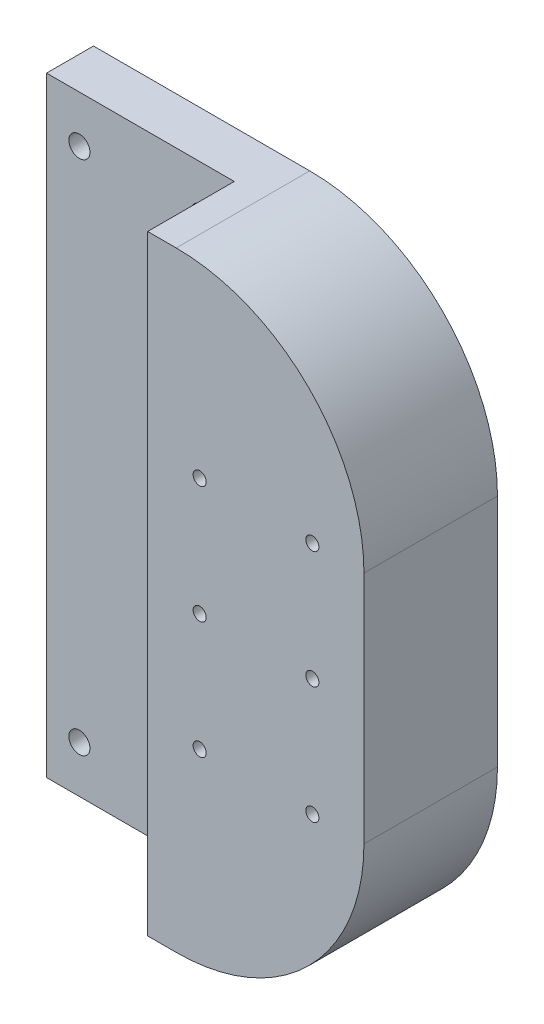
ISO-10303-21;
HEADER;
FILE_DESCRIPTION(('STEP AP214'),'2;1');
FILE_NAME('part.step','',(''),(''),'','','');
FILE_SCHEMA(('AUTOMOTIVE_DESIGN { 1 0 10303 214 1 1 1 1 }'));
ENDSEC;
DATA;
#1=APPLICATION_CONTEXT('core data for automotive mechanical design processes');
#2=APPLICATION_PROTOCOL_DEFINITION('international standard','automotive_design',2000,#1);
#3=PRODUCT_CONTEXT('',#1,'mechanical');
#4=PRODUCT('Part','Part','',(#3));
#5=PRODUCT_RELATED_PRODUCT_CATEGORY('part','',(#4));
#6=PRODUCT_DEFINITION_FORMATION('','',#4);
#7=PRODUCT_DEFINITION_CONTEXT('part definition',#1,'design');
#8=PRODUCT_DEFINITION('design','',#6,#7);
#9=PRODUCT_DEFINITION_SHAPE('','',#8);
#10=(LENGTH_UNIT() NAMED_UNIT(*) SI_UNIT(.MILLI.,.METRE.));
#11=(NAMED_UNIT(*) PLANE_ANGLE_UNIT() SI_UNIT($,.RADIAN.));
#12=(NAMED_UNIT(*) SI_UNIT($,.STERADIAN.) SOLID_ANGLE_UNIT());
#13=UNCERTAINTY_MEASURE_WITH_UNIT(LENGTH_MEASURE(1.E-05),#10,'distance_accuracy_value','');
#14=(GEOMETRIC_REPRESENTATION_CONTEXT(3) GLOBAL_UNCERTAINTY_ASSIGNED_CONTEXT((#13)) GLOBAL_UNIT_ASSIGNED_CONTEXT((#10,
#11,#12)) REPRESENTATION_CONTEXT('',''));
#15=CARTESIAN_POINT('',(0.,0.,0.));
#16=DIRECTION('',(0.,0.,1.));
#17=DIRECTION('',(1.,0.,0.));
#18=AXIS2_PLACEMENT_3D('',#15,#16,#17);
#19=CARTESIAN_POINT('',(0.,0.,10.));
#20=DIRECTION('',(0.,0.,1.));
#21=DIRECTION('',(1.,0.,0.));
#22=AXIS2_PLACEMENT_3D('',#19,#20,#21);
#23=PLANE('',#22);
#24=CARTESIAN_POINT('',(-36.042,55.0000004842877,10.));
#25=DIRECTION('',(0.,0.,1.));
#26=DIRECTION('',(1.,0.,0.));
#27=AXIS2_PLACEMENT_3D('',#24,#25,#26);
#28=CIRCLE('',#27,2.25000000000001);
#29=CARTESIAN_POINT('',(-33.792,55.0000004842877,10.));
#30=VERTEX_POINT('',#29);
#31=EDGE_CURVE('E156',#30,#30,#28,.T.);
#32=ORIENTED_EDGE('',*,*,#31,.F.);
#33=EDGE_LOOP('',(#32));
#34=FACE_BOUND('',#33,.T.);
#35=CARTESIAN_POINT('',(-10.042,-54.9999995157123,10.));
#36=DIRECTION('',(0.,0.,1.));
#37=DIRECTION('',(1.,0.,0.));
#38=AXIS2_PLACEMENT_3D('',#35,#36,#37);
#39=CIRCLE('',#38,2.25000000000001);
#40=CARTESIAN_POINT('',(-7.79200000000001,-54.9999995157123,10.));
#41=VERTEX_POINT('',#40);
#42=EDGE_CURVE('E153',#41,#41,#39,.T.);
#43=ORIENTED_EDGE('',*,*,#42,.F.);
#44=EDGE_LOOP('',(#43));
#45=FACE_BOUND('',#44,.T.);
#46=CARTESIAN_POINT('',(-36.042,-54.9999995157123,10.));
#47=DIRECTION('',(0.,0.,1.));
#48=DIRECTION('',(1.,0.,0.));
#49=AXIS2_PLACEMENT_3D('',#46,#47,#48);
#50=CIRCLE('',#49,2.25000000000001);
#51=CARTESIAN_POINT('',(-33.792,-54.9999995157123,10.));
#52=VERTEX_POINT('',#51);
#53=EDGE_CURVE('E149',#52,#52,#50,.T.);
#54=ORIENTED_EDGE('',*,*,#53,.F.);
#55=EDGE_LOOP('',(#54));
#56=FACE_BOUND('',#55,.T.);
#57=CARTESIAN_POINT('',(-10.042,55.0000004842877,10.));
#58=DIRECTION('',(0.,0.,1.));
#59=DIRECTION('',(1.,0.,0.));
#60=AXIS2_PLACEMENT_3D('',#57,#58,#59);
#61=CIRCLE('',#60,2.25000000000001);
#62=CARTESIAN_POINT('',(-7.79200000000001,55.0000004842877,10.));
#63=VERTEX_POINT('',#62);
#64=EDGE_CURVE('E146',#63,#63,#61,.T.);
#65=ORIENTED_EDGE('',*,*,#64,.F.);
#66=EDGE_LOOP('',(#65));
#67=FACE_BOUND('',#66,.T.);
#68=DIRECTION('',(1.,0.,0.));
#69=VECTOR('',#68,1.);
#70=CARTESIAN_POINT('',(0.,-65.0000004842878,10.));
#71=LINE('',#70,#69);
#72=CARTESIAN_POINT('',(-43.042,-65.0000004842878,10.));
#73=VERTEX_POINT('',#72);
#74=CARTESIAN_POINT('',(-3.04200000000002,-65.0000004842878,10.));
#75=VERTEX_POINT('',#74);
#76=EDGE_CURVE('E56',#73,#75,#71,.T.);
#77=ORIENTED_EDGE('',*,*,#76,.T.);
#78=DIRECTION('',(0.,1.,0.));
#79=VECTOR('',#78,1.);
#80=CARTESIAN_POINT('',(-3.04200000000002,0.,10.));
#81=LINE('',#80,#79);
#82=CARTESIAN_POINT('',(-3.04200000000002,65.0000004842878,10.));
#83=VERTEX_POINT('',#82);
#84=EDGE_CURVE('E51',#75,#83,#81,.T.);
#85=ORIENTED_EDGE('',*,*,#84,.T.);
#86=DIRECTION('',(-1.,0.,0.));
#87=VECTOR('',#86,1.);
#88=CARTESIAN_POINT('',(0.,65.0000004842878,10.));
#89=LINE('',#88,#87);
#90=CARTESIAN_POINT('',(-43.042,65.0000004842878,10.));
#91=VERTEX_POINT('',#90);
#92=EDGE_CURVE('E162',#83,#91,#89,.T.);
#93=ORIENTED_EDGE('',*,*,#92,.T.);
#94=DIRECTION('',(0.,-1.,0.));
#95=VECTOR('',#94,1.);
#96=CARTESIAN_POINT('',(-43.042,0.,10.));
#97=LINE('',#96,#95);
#98=EDGE_CURVE('E159',#91,#73,#97,.T.);
#99=ORIENTED_EDGE('',*,*,#98,.T.);
#100=EDGE_LOOP('',(#77,#85,#93,#99));
#101=FACE_BOUND('',#100,.T.);
#102=ADVANCED_FACE('F36',(#34,#45,#56,#67,#101),#23,.T.);
#103=CARTESIAN_POINT('',(-43.042,0.,10.));
#104=DIRECTION('',(1.,0.,0.));
#105=DIRECTION('',(0.,0.,-1.));
#106=AXIS2_PLACEMENT_3D('',#103,#104,#105);
#107=PLANE('',#106);
#108=DIRECTION('',(0.,-1.,0.));
#109=VECTOR('',#108,1.);
#110=CARTESIAN_POINT('',(-43.042,0.,0.));
#111=LINE('',#110,#109);
#112=CARTESIAN_POINT('',(-43.042,65.0000004842878,0.));
#113=VERTEX_POINT('',#112);
#114=CARTESIAN_POINT('',(-43.042,-65.0000004842878,0.));
#115=VERTEX_POINT('',#114);
#116=EDGE_CURVE('E176',#113,#115,#111,.T.);
#117=ORIENTED_EDGE('',*,*,#116,.T.);
#118=DIRECTION('',(0.,0.,-1.));
#119=VECTOR('',#118,1.);
#120=CARTESIAN_POINT('',(-43.042,-65.0000004842878,10.));
#121=LINE('',#120,#119);
#122=EDGE_CURVE('E11',#73,#115,#121,.T.);
#123=ORIENTED_EDGE('',*,*,#122,.F.);
#124=ORIENTED_EDGE('',*,*,#98,.F.);
#125=DIRECTION('',(0.,0.,-1.));
#126=VECTOR('',#125,1.);
#127=CARTESIAN_POINT('',(-43.042,65.0000004842878,10.));
#128=LINE('',#127,#126);
#129=EDGE_CURVE('E164',#91,#113,#128,.T.);
#130=ORIENTED_EDGE('',*,*,#129,.T.);
#131=EDGE_LOOP('',(#117,#123,#124,#130));
#132=FACE_BOUND('',#131,.T.);
#133=ADVANCED_FACE('F229',(#132),#107,.F.);
#134=CARTESIAN_POINT('',(0.,-65.0000004842878,10.));
#135=DIRECTION('',(0.,1.,0.));
#136=DIRECTION('',(0.,0.,1.));
#137=AXIS2_PLACEMENT_3D('',#134,#135,#136);
#138=PLANE('',#137);
#139=DIRECTION('',(0.,0.,-1.));
#140=VECTOR('',#139,1.);
#141=CARTESIAN_POINT('',(3.04199999999999,-65.0000004842878,10.));
#142=LINE('',#141,#140);
#143=CARTESIAN_POINT('',(3.04199999999999,-65.0000004842878,28.45));
#144=VERTEX_POINT('',#143);
#145=CARTESIAN_POINT('',(3.04199999999999,-65.0000004842878,0.));
#146=VERTEX_POINT('',#145);
#147=EDGE_CURVE('E44',#144,#146,#142,.T.);
#148=ORIENTED_EDGE('',*,*,#147,.F.);
#149=DIRECTION('',(1.,0.,0.));
#150=VECTOR('',#149,1.);
#151=CARTESIAN_POINT('',(0.,-65.0000004842878,28.45));
#152=LINE('',#151,#150);
#153=CARTESIAN_POINT('',(-3.04200000000002,-65.0000004842878,28.45));
#154=VERTEX_POINT('',#153);
#155=EDGE_CURVE('E135',#154,#144,#152,.T.);
#156=ORIENTED_EDGE('',*,*,#155,.F.);
#157=DIRECTION('',(0.,0.,-1.));
#158=VECTOR('',#157,1.);
#159=CARTESIAN_POINT('',(-3.04200000000002,-65.0000004842878,28.45));
#160=LINE('',#159,#158);
#161=EDGE_CURVE('E138',#154,#75,#160,.T.);
#162=ORIENTED_EDGE('',*,*,#161,.T.);
#163=ORIENTED_EDGE('',*,*,#76,.F.);
#164=ORIENTED_EDGE('',*,*,#122,.T.);
#165=DIRECTION('',(1.,0.,0.));
#166=VECTOR('',#165,1.);
#167=CARTESIAN_POINT('',(0.,-65.0000004842878,0.));
#168=LINE('',#167,#166);
#169=EDGE_CURVE('E179',#115,#146,#168,.T.);
#170=ORIENTED_EDGE('',*,*,#169,.T.);
#171=EDGE_LOOP('',(#148,#156,#162,#163,#164,#170));
#172=FACE_BOUND('',#171,.T.);
#173=ADVANCED_FACE('F227',(#172),#138,.F.);
#174=CARTESIAN_POINT('',(3.04199999999999,-25.0000004842877,10.));
#175=DIRECTION('',(0.,0.,-1.));
#176=DIRECTION('',(-1.,0.,0.));
#177=AXIS2_PLACEMENT_3D('',#174,#175,#176);
#178=CYLINDRICAL_SURFACE('',#177,40.);
#179=CARTESIAN_POINT('',(3.04199999999999,-25.0000004842877,0.));
#180=DIRECTION('',(0.,0.,1.));
#181=DIRECTION('',(1.,0.,0.));
#182=AXIS2_PLACEMENT_3D('',#179,#180,#181);
#183=CIRCLE('',#182,40.);
#184=CARTESIAN_POINT('',(43.042,-25.0000004842877,0.));
#185=VERTEX_POINT('',#184);
#186=EDGE_CURVE('E181',#146,#185,#183,.T.);
#187=ORIENTED_EDGE('',*,*,#186,.T.);
#188=DIRECTION('',(0.,0.,-1.));
#189=VECTOR('',#188,1.);
#190=CARTESIAN_POINT('',(43.042,-25.0000004842877,10.));
#191=LINE('',#190,#189);
#192=CARTESIAN_POINT('',(43.042,-25.0000004842877,28.45));
#193=VERTEX_POINT('',#192);
#194=EDGE_CURVE('E109',#193,#185,#191,.T.);
#195=ORIENTED_EDGE('',*,*,#194,.F.);
#196=CARTESIAN_POINT('',(3.04199999999999,-25.0000004842877,28.45));
#197=DIRECTION('',(0.,0.,1.));
#198=DIRECTION('',(1.,0.,0.));
#199=AXIS2_PLACEMENT_3D('',#196,#197,#198);
#200=CIRCLE('',#199,40.);
#201=EDGE_CURVE('E124',#144,#193,#200,.T.);
#202=ORIENTED_EDGE('',*,*,#201,.F.);
#203=ORIENTED_EDGE('',*,*,#147,.T.);
#204=EDGE_LOOP('',(#187,#195,#202,#203));
#205=FACE_BOUND('',#204,.T.);
#206=ADVANCED_FACE('F211',(#205),#178,.T.);
#207=CARTESIAN_POINT('',(43.042,0.,10.));
#208=DIRECTION('',(-1.,0.,0.));
#209=DIRECTION('',(0.,0.,1.));
#210=AXIS2_PLACEMENT_3D('',#207,#208,#209);
#211=PLANE('',#210);
#212=DIRECTION('',(0.,1.,0.));
#213=VECTOR('',#212,1.);
#214=CARTESIAN_POINT('',(43.042,0.,0.));
#215=LINE('',#214,#213);
#216=CARTESIAN_POINT('',(43.042,25.0000004842874,0.));
#217=VERTEX_POINT('',#216);
#218=EDGE_CURVE('E106',#185,#217,#215,.T.);
#219=ORIENTED_EDGE('',*,*,#218,.T.);
#220=DIRECTION('',(0.,0.,-1.));
#221=VECTOR('',#220,1.);
#222=CARTESIAN_POINT('',(43.042,25.0000004842874,10.));
#223=LINE('',#222,#221);
#224=CARTESIAN_POINT('',(43.042,25.0000004842874,28.45));
#225=VERTEX_POINT('',#224);
#226=EDGE_CURVE('E99',#225,#217,#223,.T.);
#227=ORIENTED_EDGE('',*,*,#226,.F.);
#228=DIRECTION('',(0.,1.,0.));
#229=VECTOR('',#228,1.);
#230=CARTESIAN_POINT('',(43.042,0.,28.45));
#231=LINE('',#230,#229);
#232=EDGE_CURVE('E104',#193,#225,#231,.T.);
#233=ORIENTED_EDGE('',*,*,#232,.F.);
#234=ORIENTED_EDGE('',*,*,#194,.T.);
#235=EDGE_LOOP('',(#219,#227,#233,#234));
#236=FACE_BOUND('',#235,.T.);
#237=ADVANCED_FACE('F101',(#236),#211,.F.);
#238=CARTESIAN_POINT('',(3.04199999999999,25.0000004842874,10.));
#239=DIRECTION('',(0.,0.,-1.));
#240=DIRECTION('',(-1.,0.,0.));
#241=AXIS2_PLACEMENT_3D('',#238,#239,#240);
#242=CYLINDRICAL_SURFACE('',#241,40.0000000000002);
#243=CARTESIAN_POINT('',(3.04199999999999,25.0000004842874,0.));
#244=DIRECTION('',(0.,0.,1.));
#245=DIRECTION('',(1.,0.,0.));
#246=AXIS2_PLACEMENT_3D('',#243,#244,#245);
#247=CIRCLE('',#246,40.0000000000002);
#248=CARTESIAN_POINT('',(3.04199999999999,65.0000004842878,0.));
#249=VERTEX_POINT('',#248);
#250=EDGE_CURVE('E184',#217,#249,#247,.T.);
#251=ORIENTED_EDGE('',*,*,#250,.T.);
#252=DIRECTION('',(0.,0.,-1.));
#253=VECTOR('',#252,1.);
#254=CARTESIAN_POINT('',(3.04199999999999,65.0000004842878,10.));
#255=LINE('',#254,#253);
#256=CARTESIAN_POINT('',(3.04199999999999,65.0000004842878,28.45));
#257=VERTEX_POINT('',#256);
#258=EDGE_CURVE('E110',#257,#249,#255,.T.);
#259=ORIENTED_EDGE('',*,*,#258,.F.);
#260=CARTESIAN_POINT('',(3.04199999999999,25.0000004842874,28.45));
#261=DIRECTION('',(0.,0.,1.));
#262=DIRECTION('',(1.,0.,0.));
#263=AXIS2_PLACEMENT_3D('',#260,#261,#262);
#264=CIRCLE('',#263,40.0000000000002);
#265=EDGE_CURVE('E113',#225,#257,#264,.T.);
#266=ORIENTED_EDGE('',*,*,#265,.F.);
#267=ORIENTED_EDGE('',*,*,#226,.T.);
#268=EDGE_LOOP('',(#251,#259,#266,#267));
#269=FACE_BOUND('',#268,.T.);
#270=ADVANCED_FACE('F114',(#269),#242,.T.);
#271=CARTESIAN_POINT('',(8.04176889491998,25.0000004842877,10.));
#272=DIRECTION('',(0.,0.,-1.));
#273=DIRECTION('',(-1.,0.,0.));
#274=AXIS2_PLACEMENT_3D('',#271,#272,#273);
#275=CYLINDRICAL_SURFACE('',#274,1.39999999999997);
#276=CARTESIAN_POINT('',(8.04176889491998,25.0000004842877,0.));
#277=DIRECTION('',(0.,0.,1.));
#278=DIRECTION('',(1.,0.,0.));
#279=AXIS2_PLACEMENT_3D('',#276,#277,#278);
#280=CIRCLE('',#279,1.39999999999997);
#281=CARTESIAN_POINT('',(9.44176889491995,25.0000004842877,0.));
#282=VERTEX_POINT('',#281);
#283=EDGE_CURVE('E200',#282,#282,#280,.T.);
#284=ORIENTED_EDGE('',*,*,#283,.F.);
#285=EDGE_LOOP('',(#284));
#286=FACE_BOUND('',#285,.T.);
#287=CARTESIAN_POINT('',(8.04176889491998,25.0000004842877,28.45));
#288=DIRECTION('',(0.,0.,1.));
#289=DIRECTION('',(1.,0.,0.));
#290=AXIS2_PLACEMENT_3D('',#287,#288,#289);
#291=CIRCLE('',#290,1.39999999999997);
#292=CARTESIAN_POINT('',(9.44176889491995,25.0000004842877,28.45));
#293=VERTEX_POINT('',#292);
#294=EDGE_CURVE('E128',#293,#293,#291,.T.);
#295=ORIENTED_EDGE('',*,*,#294,.T.);
#296=EDGE_LOOP('',(#295));
#297=FACE_BOUND('',#296,.T.);
#298=ADVANCED_FACE('F254',(#286,#297),#275,.F.);
#299=CARTESIAN_POINT('',(8.04176889491998,0.,10.));
#300=DIRECTION('',(0.,0.,-1.));
#301=DIRECTION('',(-1.,0.,0.));
#302=AXIS2_PLACEMENT_3D('',#299,#300,#301);
#303=CYLINDRICAL_SURFACE('',#302,1.39999999999997);
#304=CARTESIAN_POINT('',(8.04176889491998,0.,0.));
#305=DIRECTION('',(0.,0.,1.));
#306=DIRECTION('',(1.,0.,0.));
#307=AXIS2_PLACEMENT_3D('',#304,#305,#306);
#308=CIRCLE('',#307,1.39999999999997);
#309=CARTESIAN_POINT('',(9.44176889491995,0.,0.));
#310=VERTEX_POINT('',#309);
#311=EDGE_CURVE('E197',#310,#310,#308,.T.);
#312=ORIENTED_EDGE('',*,*,#311,.F.);
#313=EDGE_LOOP('',(#312));
#314=FACE_BOUND('',#313,.T.);
#315=CARTESIAN_POINT('',(8.04176889491998,0.,28.45));
#316=DIRECTION('',(0.,0.,1.));
#317=DIRECTION('',(1.,0.,0.));
#318=AXIS2_PLACEMENT_3D('',#315,#316,#317);
#319=CIRCLE('',#318,1.39999999999997);
#320=CARTESIAN_POINT('',(9.44176889491995,0.,28.45));
#321=VERTEX_POINT('',#320);
#322=EDGE_CURVE('E476',#321,#321,#319,.T.);
#323=ORIENTED_EDGE('',*,*,#322,.T.);
#324=EDGE_LOOP('',(#323));
#325=FACE_BOUND('',#324,.T.);
#326=ADVANCED_FACE('F257',(#314,#325),#303,.F.);
#327=CARTESIAN_POINT('',(32.04176889492,25.0000004842877,10.));
#328=DIRECTION('',(0.,0.,-1.));
#329=DIRECTION('',(-1.,0.,0.));
#330=AXIS2_PLACEMENT_3D('',#327,#328,#329);
#331=CYLINDRICAL_SURFACE('',#330,1.4);
#332=CARTESIAN_POINT('',(32.04176889492,25.0000004842877,0.));
#333=DIRECTION('',(0.,0.,1.));
#334=DIRECTION('',(1.,0.,0.));
#335=AXIS2_PLACEMENT_3D('',#332,#333,#334);
#336=CIRCLE('',#335,1.4);
#337=CARTESIAN_POINT('',(33.44176889492,25.0000004842877,0.));
#338=VERTEX_POINT('',#337);
#339=EDGE_CURVE('E194',#338,#338,#336,.T.);
#340=ORIENTED_EDGE('',*,*,#339,.F.);
#341=EDGE_LOOP('',(#340));
#342=FACE_BOUND('',#341,.T.);
#343=CARTESIAN_POINT('',(32.04176889492,25.0000004842877,28.45));
#344=DIRECTION('',(0.,0.,1.));
#345=DIRECTION('',(1.,0.,0.));
#346=AXIS2_PLACEMENT_3D('',#343,#344,#345);
#347=CIRCLE('',#346,1.4);
#348=CARTESIAN_POINT('',(33.44176889492,25.0000004842877,28.45));
#349=VERTEX_POINT('',#348);
#350=EDGE_CURVE('E472',#349,#349,#347,.T.);
#351=ORIENTED_EDGE('',*,*,#350,.T.);
#352=EDGE_LOOP('',(#351));
#353=FACE_BOUND('',#352,.T.);
#354=ADVANCED_FACE('F261',(#342,#353),#331,.F.);
#355=CARTESIAN_POINT('',(32.04176889492,-25.0000004842877,10.));
#356=DIRECTION('',(0.,0.,-1.));
#357=DIRECTION('',(-1.,0.,0.));
#358=AXIS2_PLACEMENT_3D('',#355,#356,#357);
#359=CYLINDRICAL_SURFACE('',#358,1.4);
#360=CARTESIAN_POINT('',(32.04176889492,-25.0000004842877,0.));
#361=DIRECTION('',(0.,0.,1.));
#362=DIRECTION('',(1.,0.,0.));
#363=AXIS2_PLACEMENT_3D('',#360,#361,#362);
#364=CIRCLE('',#363,1.4);
#365=CARTESIAN_POINT('',(33.44176889492,-25.0000004842877,0.));
#366=VERTEX_POINT('',#365);
#367=EDGE_CURVE('E191',#366,#366,#364,.T.);
#368=ORIENTED_EDGE('',*,*,#367,.F.);
#369=EDGE_LOOP('',(#368));
#370=FACE_BOUND('',#369,.T.);
#371=CARTESIAN_POINT('',(32.04176889492,-25.0000004842877,28.45));
#372=DIRECTION('',(0.,0.,1.));
#373=DIRECTION('',(1.,0.,0.));
#374=AXIS2_PLACEMENT_3D('',#371,#372,#373);
#375=CIRCLE('',#374,1.4);
#376=CARTESIAN_POINT('',(33.44176889492,-25.0000004842877,28.45));
#377=VERTEX_POINT('',#376);
#378=EDGE_CURVE('E468',#377,#377,#375,.T.);
#379=ORIENTED_EDGE('',*,*,#378,.T.);
#380=EDGE_LOOP('',(#379));
#381=FACE_BOUND('',#380,.T.);
#382=ADVANCED_FACE('F265',(#370,#381),#359,.F.);
#383=CARTESIAN_POINT('',(32.04176889492,0.,10.));
#384=DIRECTION('',(0.,0.,-1.));
#385=DIRECTION('',(-1.,0.,0.));
#386=AXIS2_PLACEMENT_3D('',#383,#384,#385);
#387=CYLINDRICAL_SURFACE('',#386,1.4);
#388=CARTESIAN_POINT('',(32.04176889492,0.,0.));
#389=DIRECTION('',(0.,0.,1.));
#390=DIRECTION('',(1.,0.,0.));
#391=AXIS2_PLACEMENT_3D('',#388,#389,#390);
#392=CIRCLE('',#391,1.4);
#393=CARTESIAN_POINT('',(33.44176889492,0.,0.));
#394=VERTEX_POINT('',#393);
#395=EDGE_CURVE('E188',#394,#394,#392,.T.);
#396=ORIENTED_EDGE('',*,*,#395,.F.);
#397=EDGE_LOOP('',(#396));
#398=FACE_BOUND('',#397,.T.);
#399=CARTESIAN_POINT('',(32.04176889492,0.,28.45));
#400=DIRECTION('',(0.,0.,1.));
#401=DIRECTION('',(1.,0.,0.));
#402=AXIS2_PLACEMENT_3D('',#399,#400,#401);
#403=CIRCLE('',#402,1.4);
#404=CARTESIAN_POINT('',(33.44176889492,0.,28.45));
#405=VERTEX_POINT('',#404);
#406=EDGE_CURVE('E464',#405,#405,#403,.T.);
#407=ORIENTED_EDGE('',*,*,#406,.T.);
#408=EDGE_LOOP('',(#407));
#409=FACE_BOUND('',#408,.T.);
#410=ADVANCED_FACE('F269',(#398,#409),#387,.F.);
#411=CARTESIAN_POINT('',(0.,65.0000004842878,10.));
#412=DIRECTION('',(0.,-1.,0.));
#413=DIRECTION('',(0.,0.,-1.));
#414=AXIS2_PLACEMENT_3D('',#411,#412,#413);
#415=PLANE('',#414);
#416=DIRECTION('',(-1.,0.,0.));
#417=VECTOR('',#416,1.);
#418=CARTESIAN_POINT('',(0.,65.0000004842878,0.));
#419=LINE('',#418,#417);
#420=EDGE_CURVE('E186',#249,#113,#419,.T.);
#421=ORIENTED_EDGE('',*,*,#420,.T.);
#422=ORIENTED_EDGE('',*,*,#129,.F.);
#423=ORIENTED_EDGE('',*,*,#92,.F.);
#424=DIRECTION('',(0.,0.,-1.));
#425=VECTOR('',#424,1.);
#426=CARTESIAN_POINT('',(-3.04200000000002,65.0000004842878,28.45));
#427=LINE('',#426,#425);
#428=CARTESIAN_POINT('',(-3.04200000000002,65.0000004842878,28.45));
#429=VERTEX_POINT('',#428);
#430=EDGE_CURVE('E141',#429,#83,#427,.T.);
#431=ORIENTED_EDGE('',*,*,#430,.F.);
#432=DIRECTION('',(-1.,0.,0.));
#433=VECTOR('',#432,1.);
#434=CARTESIAN_POINT('',(0.,65.0000004842878,28.45));
#435=LINE('',#434,#433);
#436=EDGE_CURVE('E118',#257,#429,#435,.T.);
#437=ORIENTED_EDGE('',*,*,#436,.F.);
#438=ORIENTED_EDGE('',*,*,#258,.T.);
#439=EDGE_LOOP('',(#421,#422,#423,#431,#437,#438));
#440=FACE_BOUND('',#439,.T.);
#441=ADVANCED_FACE('F220',(#440),#415,.F.);
#442=CARTESIAN_POINT('',(-36.042,55.0000004842877,10.));
#443=DIRECTION('',(0.,0.,-1.));
#444=DIRECTION('',(-1.,0.,0.));
#445=AXIS2_PLACEMENT_3D('',#442,#443,#444);
#446=CYLINDRICAL_SURFACE('',#445,2.25000000000001);
#447=ORIENTED_EDGE('',*,*,#31,.T.);
#448=EDGE_LOOP('',(#447));
#449=FACE_BOUND('',#448,.T.);
#450=CARTESIAN_POINT('',(-36.042,55.0000004842877,0.));
#451=DIRECTION('',(0.,0.,1.));
#452=DIRECTION('',(1.,0.,0.));
#453=AXIS2_PLACEMENT_3D('',#450,#451,#452);
#454=CIRCLE('',#453,2.25000000000001);
#455=CARTESIAN_POINT('',(-33.792,55.0000004842877,0.));
#456=VERTEX_POINT('',#455);
#457=EDGE_CURVE('E173',#456,#456,#454,.T.);
#458=ORIENTED_EDGE('',*,*,#457,.F.);
#459=EDGE_LOOP('',(#458));
#460=FACE_BOUND('',#459,.T.);
#461=ADVANCED_FACE('F276',(#449,#460),#446,.F.);
#462=CARTESIAN_POINT('',(-10.042,-54.9999995157123,10.));
#463=DIRECTION('',(0.,0.,-1.));
#464=DIRECTION('',(-1.,0.,0.));
#465=AXIS2_PLACEMENT_3D('',#462,#463,#464);
#466=CYLINDRICAL_SURFACE('',#465,2.25000000000001);
#467=ORIENTED_EDGE('',*,*,#42,.T.);
#468=EDGE_LOOP('',(#467));
#469=FACE_BOUND('',#468,.T.);
#470=CARTESIAN_POINT('',(-10.042,-54.9999995157123,0.));
#471=DIRECTION('',(0.,0.,1.));
#472=DIRECTION('',(1.,0.,0.));
#473=AXIS2_PLACEMENT_3D('',#470,#471,#472);
#474=CIRCLE('',#473,2.25000000000001);
#475=CARTESIAN_POINT('',(-7.79200000000001,-54.9999995157123,0.));
#476=VERTEX_POINT('',#475);
#477=EDGE_CURVE('E170',#476,#476,#474,.T.);
#478=ORIENTED_EDGE('',*,*,#477,.F.);
#479=EDGE_LOOP('',(#478));
#480=FACE_BOUND('',#479,.T.);
#481=ADVANCED_FACE('F320',(#469,#480),#466,.F.);
#482=CARTESIAN_POINT('',(-36.042,-54.9999995157123,10.));
#483=DIRECTION('',(0.,0.,-1.));
#484=DIRECTION('',(-1.,0.,0.));
#485=AXIS2_PLACEMENT_3D('',#482,#483,#484);
#486=CYLINDRICAL_SURFACE('',#485,2.25000000000001);
#487=ORIENTED_EDGE('',*,*,#53,.T.);
#488=EDGE_LOOP('',(#487));
#489=FACE_BOUND('',#488,.T.);
#490=CARTESIAN_POINT('',(-36.042,-54.9999995157123,0.));
#491=DIRECTION('',(0.,0.,1.));
#492=DIRECTION('',(1.,0.,0.));
#493=AXIS2_PLACEMENT_3D('',#490,#491,#492);
#494=CIRCLE('',#493,2.25000000000001);
#495=CARTESIAN_POINT('',(-33.792,-54.9999995157123,0.));
#496=VERTEX_POINT('',#495);
#497=EDGE_CURVE('E167',#496,#496,#494,.T.);
#498=ORIENTED_EDGE('',*,*,#497,.F.);
#499=EDGE_LOOP('',(#498));
#500=FACE_BOUND('',#499,.T.);
#501=ADVANCED_FACE('F329',(#489,#500),#486,.F.);
#502=CARTESIAN_POINT('',(-10.042,55.0000004842877,10.));
#503=DIRECTION('',(0.,0.,-1.));
#504=DIRECTION('',(-1.,0.,0.));
#505=AXIS2_PLACEMENT_3D('',#502,#503,#504);
#506=CYLINDRICAL_SURFACE('',#505,2.25000000000001);
#507=ORIENTED_EDGE('',*,*,#64,.T.);
#508=EDGE_LOOP('',(#507));
#509=FACE_BOUND('',#508,.T.);
#510=CARTESIAN_POINT('',(-10.042,55.0000004842877,0.));
#511=DIRECTION('',(0.,0.,1.));
#512=DIRECTION('',(1.,0.,0.));
#513=AXIS2_PLACEMENT_3D('',#510,#511,#512);
#514=CIRCLE('',#513,2.25000000000001);
#515=CARTESIAN_POINT('',(-7.79200000000001,55.0000004842877,0.));
#516=VERTEX_POINT('',#515);
#517=EDGE_CURVE('E145',#516,#516,#514,.T.);
#518=ORIENTED_EDGE('',*,*,#517,.F.);
#519=EDGE_LOOP('',(#518));
#520=FACE_BOUND('',#519,.T.);
#521=ADVANCED_FACE('F38',(#509,#520),#506,.F.);
#522=CARTESIAN_POINT('',(8.04176889491998,-25.0000004842877,10.));
#523=DIRECTION('',(0.,0.,-1.));
#524=DIRECTION('',(-1.,0.,0.));
#525=AXIS2_PLACEMENT_3D('',#522,#523,#524);
#526=CYLINDRICAL_SURFACE('',#525,1.39999999999997);
#527=CARTESIAN_POINT('',(8.04176889491998,-25.0000004842877,0.));
#528=DIRECTION('',(0.,0.,1.));
#529=DIRECTION('',(1.,0.,0.));
#530=AXIS2_PLACEMENT_3D('',#527,#528,#529);
#531=CIRCLE('',#530,1.39999999999997);
#532=CARTESIAN_POINT('',(9.44176889491995,-25.0000004842877,0.));
#533=VERTEX_POINT('',#532);
#534=EDGE_CURVE('E150',#533,#533,#531,.T.);
#535=ORIENTED_EDGE('',*,*,#534,.F.);
#536=EDGE_LOOP('',(#535));
#537=FACE_BOUND('',#536,.T.);
#538=CARTESIAN_POINT('',(8.04176889491998,-25.0000004842877,28.45));
#539=DIRECTION('',(0.,0.,1.));
#540=DIRECTION('',(1.,0.,0.));
#541=AXIS2_PLACEMENT_3D('',#538,#539,#540);
#542=CIRCLE('',#541,1.39999999999997);
#543=CARTESIAN_POINT('',(9.44176889491995,-25.0000004842877,28.45));
#544=VERTEX_POINT('',#543);
#545=EDGE_CURVE('E125',#544,#544,#542,.T.);
#546=ORIENTED_EDGE('',*,*,#545,.T.);
#547=EDGE_LOOP('',(#546));
#548=FACE_BOUND('',#547,.T.);
#549=ADVANCED_FACE('F250',(#537,#548),#526,.F.);
#550=CARTESIAN_POINT('',(0.,0.,0.));
#551=DIRECTION('',(0.,0.,1.));
#552=DIRECTION('',(1.,0.,0.));
#553=AXIS2_PLACEMENT_3D('',#550,#551,#552);
#554=PLANE('',#553);
#555=ORIENTED_EDGE('',*,*,#186,.F.);
#556=ORIENTED_EDGE('',*,*,#169,.F.);
#557=ORIENTED_EDGE('',*,*,#116,.F.);
#558=ORIENTED_EDGE('',*,*,#420,.F.);
#559=ORIENTED_EDGE('',*,*,#250,.F.);
#560=ORIENTED_EDGE('',*,*,#218,.F.);
#561=EDGE_LOOP('',(#555,#556,#557,#558,#559,#560));
#562=FACE_BOUND('',#561,.T.);
#563=ORIENTED_EDGE('',*,*,#395,.T.);
#564=EDGE_LOOP('',(#563));
#565=FACE_BOUND('',#564,.T.);
#566=ORIENTED_EDGE('',*,*,#367,.T.);
#567=EDGE_LOOP('',(#566));
#568=FACE_BOUND('',#567,.T.);
#569=ORIENTED_EDGE('',*,*,#339,.T.);
#570=EDGE_LOOP('',(#569));
#571=FACE_BOUND('',#570,.T.);
#572=ORIENTED_EDGE('',*,*,#311,.T.);
#573=EDGE_LOOP('',(#572));
#574=FACE_BOUND('',#573,.T.);
#575=ORIENTED_EDGE('',*,*,#283,.T.);
#576=EDGE_LOOP('',(#575));
#577=FACE_BOUND('',#576,.T.);
#578=ORIENTED_EDGE('',*,*,#534,.T.);
#579=EDGE_LOOP('',(#578));
#580=FACE_BOUND('',#579,.T.);
#581=ORIENTED_EDGE('',*,*,#457,.T.);
#582=EDGE_LOOP('',(#581));
#583=FACE_BOUND('',#582,.T.);
#584=ORIENTED_EDGE('',*,*,#477,.T.);
#585=EDGE_LOOP('',(#584));
#586=FACE_BOUND('',#585,.T.);
#587=ORIENTED_EDGE('',*,*,#497,.T.);
#588=EDGE_LOOP('',(#587));
#589=FACE_BOUND('',#588,.T.);
#590=ORIENTED_EDGE('',*,*,#517,.T.);
#591=EDGE_LOOP('',(#590));
#592=FACE_BOUND('',#591,.T.);
#593=ADVANCED_FACE('F215',(#562,#565,#568,#571,#574,#577,#580,#583,#586,#589,#592),#554,.F.);
#594=CARTESIAN_POINT('',(-3.04200000000002,0.,28.45));
#595=DIRECTION('',(1.,0.,0.));
#596=DIRECTION('',(0.,0.,-1.));
#597=AXIS2_PLACEMENT_3D('',#594,#595,#596);
#598=PLANE('',#597);
#599=ORIENTED_EDGE('',*,*,#84,.F.);
#600=ORIENTED_EDGE('',*,*,#161,.F.);
#601=DIRECTION('',(0.,-1.,0.));
#602=VECTOR('',#601,1.);
#603=CARTESIAN_POINT('',(-3.04200000000002,0.,28.45));
#604=LINE('',#603,#602);
#605=EDGE_CURVE('E133',#429,#154,#604,.T.);
#606=ORIENTED_EDGE('',*,*,#605,.F.);
#607=ORIENTED_EDGE('',*,*,#430,.T.);
#608=EDGE_LOOP('',(#599,#600,#606,#607));
#609=FACE_BOUND('',#608,.T.);
#610=ADVANCED_FACE('F226',(#609),#598,.F.);
#611=CARTESIAN_POINT('',(0.,0.,28.45));
#612=DIRECTION('',(0.,0.,1.));
#613=DIRECTION('',(1.,0.,0.));
#614=AXIS2_PLACEMENT_3D('',#611,#612,#613);
#615=PLANE('',#614);
#616=ORIENTED_EDGE('',*,*,#406,.F.);
#617=EDGE_LOOP('',(#616));
#618=FACE_BOUND('',#617,.T.);
#619=ORIENTED_EDGE('',*,*,#378,.F.);
#620=EDGE_LOOP('',(#619));
#621=FACE_BOUND('',#620,.T.);
#622=ORIENTED_EDGE('',*,*,#350,.F.);
#623=EDGE_LOOP('',(#622));
#624=FACE_BOUND('',#623,.T.);
#625=ORIENTED_EDGE('',*,*,#322,.F.);
#626=EDGE_LOOP('',(#625));
#627=FACE_BOUND('',#626,.T.);
#628=ORIENTED_EDGE('',*,*,#294,.F.);
#629=EDGE_LOOP('',(#628));
#630=FACE_BOUND('',#629,.T.);
#631=ORIENTED_EDGE('',*,*,#545,.F.);
#632=EDGE_LOOP('',(#631));
#633=FACE_BOUND('',#632,.T.);
#634=ORIENTED_EDGE('',*,*,#232,.T.);
#635=ORIENTED_EDGE('',*,*,#265,.T.);
#636=ORIENTED_EDGE('',*,*,#436,.T.);
#637=ORIENTED_EDGE('',*,*,#605,.T.);
#638=ORIENTED_EDGE('',*,*,#155,.T.);
#639=ORIENTED_EDGE('',*,*,#201,.T.);
#640=EDGE_LOOP('',(#634,#635,#636,#637,#638,#639));
#641=FACE_BOUND('',#640,.T.);
#642=ADVANCED_FACE('F121',(#618,#621,#624,#627,#630,#633,#641),#615,.T.);
#643=CLOSED_SHELL('',(#102,#133,#173,#206,#237,#270,#298,#326,#354,#382,#410,#441,#461,#481,
#501,#521,#549,#593,#610,#642));
#644=MANIFOLD_SOLID_BREP('B2',#643);
#645=ADVANCED_BREP_SHAPE_REPRESENTATION('',(#18,#644),#14);
#646=SHAPE_DEFINITION_REPRESENTATION(#9,#645);
ENDSEC;
END-ISO-10303-21;
